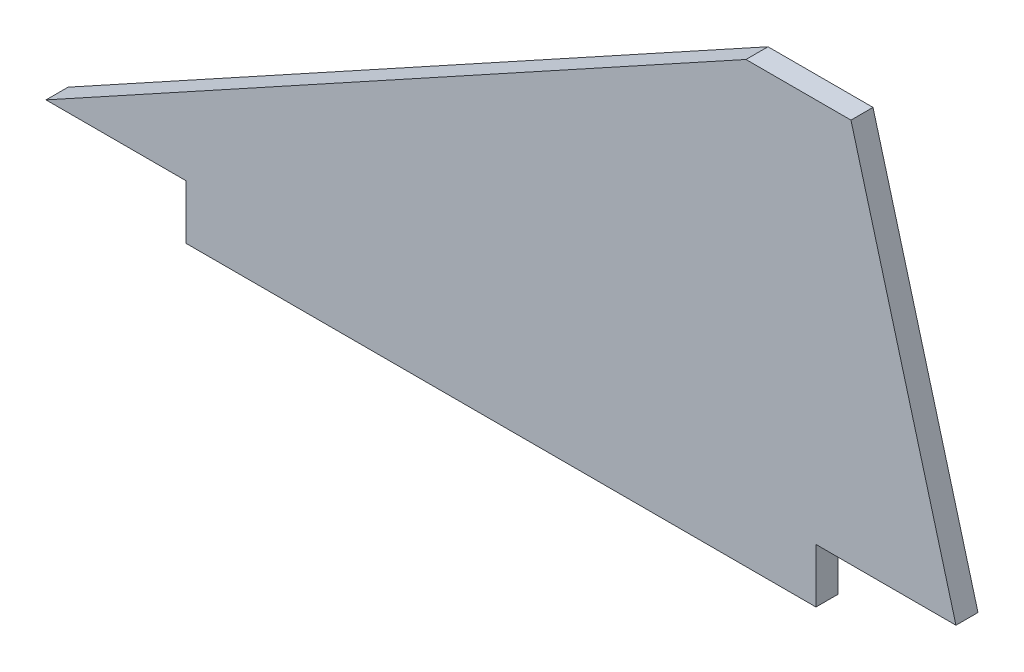
ISO-10303-21;
HEADER;
FILE_DESCRIPTION(('STEP AP214'),'2;1');
FILE_NAME('part.step','',(''),(''),'','','');
FILE_SCHEMA(('AUTOMOTIVE_DESIGN { 1 0 10303 214 1 1 1 1 }'));
ENDSEC;
DATA;
#1=APPLICATION_CONTEXT('core data for automotive mechanical design processes');
#2=APPLICATION_PROTOCOL_DEFINITION('international standard','automotive_design',2000,#1);
#3=PRODUCT_CONTEXT('',#1,'mechanical');
#4=PRODUCT('Part','Part','',(#3));
#5=PRODUCT_RELATED_PRODUCT_CATEGORY('part','',(#4));
#6=PRODUCT_DEFINITION_FORMATION('','',#4);
#7=PRODUCT_DEFINITION_CONTEXT('part definition',#1,'design');
#8=PRODUCT_DEFINITION('design','',#6,#7);
#9=PRODUCT_DEFINITION_SHAPE('','',#8);
#10=(LENGTH_UNIT() NAMED_UNIT(*) SI_UNIT(.MILLI.,.METRE.));
#11=(NAMED_UNIT(*) PLANE_ANGLE_UNIT() SI_UNIT($,.RADIAN.));
#12=(NAMED_UNIT(*) SI_UNIT($,.STERADIAN.) SOLID_ANGLE_UNIT());
#13=UNCERTAINTY_MEASURE_WITH_UNIT(LENGTH_MEASURE(1.E-05),#10,'distance_accuracy_value','');
#14=(GEOMETRIC_REPRESENTATION_CONTEXT(3) GLOBAL_UNCERTAINTY_ASSIGNED_CONTEXT((#13)) GLOBAL_UNIT_ASSIGNED_CONTEXT((#10,
#11,#12)) REPRESENTATION_CONTEXT('',''));
#15=CARTESIAN_POINT('',(0.,0.,0.));
#16=DIRECTION('',(0.,0.,1.));
#17=DIRECTION('',(1.,0.,0.));
#18=AXIS2_PLACEMENT_3D('',#15,#16,#17);
#19=CARTESIAN_POINT('',(100.,55.,3.1496));
#20=DIRECTION('',(0.481918749772156,-0.876215908676647,0.));
#21=DIRECTION('',(0.876215908676647,0.481918749772156,0.));
#22=AXIS2_PLACEMENT_3D('',#19,#20,#21);
#23=PLANE('',#22);
#24=DIRECTION('',(-0.876215908676647,-0.481918749772156,0.));
#25=VECTOR('',#24,1.);
#26=CARTESIAN_POINT('',(100.,55.,0.));
#27=LINE('',#26,#25);
#28=CARTESIAN_POINT('',(100.,55.,0.));
#29=VERTEX_POINT('',#28);
#30=CARTESIAN_POINT('',(0.,0.,0.));
#31=VERTEX_POINT('',#30);
#32=EDGE_CURVE('E130',#29,#31,#27,.T.);
#33=ORIENTED_EDGE('',*,*,#32,.T.);
#34=DIRECTION('',(0.,0.,-1.));
#35=VECTOR('',#34,1.);
#36=CARTESIAN_POINT('',(0.,0.,3.1496));
#37=LINE('',#36,#35);
#38=CARTESIAN_POINT('',(0.,0.,3.1496));
#39=VERTEX_POINT('',#38);
#40=EDGE_CURVE('E11',#39,#31,#37,.T.);
#41=ORIENTED_EDGE('',*,*,#40,.F.);
#42=DIRECTION('',(-0.876215908676647,-0.481918749772156,0.));
#43=VECTOR('',#42,1.);
#44=CARTESIAN_POINT('',(100.,55.,3.1496));
#45=LINE('',#44,#43);
#46=CARTESIAN_POINT('',(100.,55.,3.1496));
#47=VERTEX_POINT('',#46);
#48=EDGE_CURVE('E144',#47,#39,#45,.T.);
#49=ORIENTED_EDGE('',*,*,#48,.F.);
#50=DIRECTION('',(0.,0.,-1.));
#51=VECTOR('',#50,1.);
#52=CARTESIAN_POINT('',(100.,55.,3.1496));
#53=LINE('',#52,#51);
#54=EDGE_CURVE('E126',#47,#29,#53,.T.);
#55=ORIENTED_EDGE('',*,*,#54,.T.);
#56=EDGE_LOOP('',(#33,#41,#49,#55));
#57=FACE_BOUND('',#56,.T.);
#58=ADVANCED_FACE('F34',(#57),#23,.F.);
#59=CARTESIAN_POINT('',(0.,0.,3.1496));
#60=DIRECTION('',(0.,1.,0.));
#61=DIRECTION('',(0.,0.,1.));
#62=AXIS2_PLACEMENT_3D('',#59,#60,#61);
#63=PLANE('',#62);
#64=DIRECTION('',(1.,0.,0.));
#65=VECTOR('',#64,1.);
#66=CARTESIAN_POINT('',(0.,0.,0.));
#67=LINE('',#66,#65);
#68=CARTESIAN_POINT('',(20.,0.,0.));
#69=VERTEX_POINT('',#68);
#70=EDGE_CURVE('E133',#31,#69,#67,.T.);
#71=ORIENTED_EDGE('',*,*,#70,.T.);
#72=DIRECTION('',(0.,0.,-1.));
#73=VECTOR('',#72,1.);
#74=CARTESIAN_POINT('',(20.,0.,3.1496));
#75=LINE('',#74,#73);
#76=CARTESIAN_POINT('',(20.,0.,3.1496));
#77=VERTEX_POINT('',#76);
#78=EDGE_CURVE('E42',#77,#69,#75,.T.);
#79=ORIENTED_EDGE('',*,*,#78,.F.);
#80=DIRECTION('',(1.,0.,0.));
#81=VECTOR('',#80,1.);
#82=CARTESIAN_POINT('',(0.,0.,3.1496));
#83=LINE('',#82,#81);
#84=EDGE_CURVE('E93',#39,#77,#83,.T.);
#85=ORIENTED_EDGE('',*,*,#84,.F.);
#86=ORIENTED_EDGE('',*,*,#40,.T.);
#87=EDGE_LOOP('',(#71,#79,#85,#86));
#88=FACE_BOUND('',#87,.T.);
#89=ADVANCED_FACE('F179',(#88),#63,.F.);
#90=CARTESIAN_POINT('',(20.,0.,3.1496));
#91=DIRECTION('',(1.,0.,0.));
#92=DIRECTION('',(0.,0.,-1.));
#93=AXIS2_PLACEMENT_3D('',#90,#91,#92);
#94=PLANE('',#93);
#95=DIRECTION('',(0.,-1.,0.));
#96=VECTOR('',#95,1.);
#97=CARTESIAN_POINT('',(20.,0.,0.));
#98=LINE('',#97,#96);
#99=CARTESIAN_POINT('',(20.,-7.747,0.));
#100=VERTEX_POINT('',#99);
#101=EDGE_CURVE('E135',#69,#100,#98,.T.);
#102=ORIENTED_EDGE('',*,*,#101,.T.);
#103=DIRECTION('',(0.,0.,-1.));
#104=VECTOR('',#103,1.);
#105=CARTESIAN_POINT('',(20.,-7.747,3.1496));
#106=LINE('',#105,#104);
#107=CARTESIAN_POINT('',(20.,-7.747,3.1496));
#108=VERTEX_POINT('',#107);
#109=EDGE_CURVE('E151',#108,#100,#106,.T.);
#110=ORIENTED_EDGE('',*,*,#109,.F.);
#111=DIRECTION('',(0.,-1.,0.));
#112=VECTOR('',#111,1.);
#113=CARTESIAN_POINT('',(20.,0.,3.1496));
#114=LINE('',#113,#112);
#115=EDGE_CURVE('E159',#77,#108,#114,.T.);
#116=ORIENTED_EDGE('',*,*,#115,.F.);
#117=ORIENTED_EDGE('',*,*,#78,.T.);
#118=EDGE_LOOP('',(#102,#110,#116,#117));
#119=FACE_BOUND('',#118,.T.);
#120=ADVANCED_FACE('F157',(#119),#94,.F.);
#121=CARTESIAN_POINT('',(20.,-7.747,3.1496));
#122=DIRECTION('',(0.,1.,0.));
#123=DIRECTION('',(0.,0.,1.));
#124=AXIS2_PLACEMENT_3D('',#121,#122,#123);
#125=PLANE('',#124);
#126=DIRECTION('',(1.,0.,0.));
#127=VECTOR('',#126,1.);
#128=CARTESIAN_POINT('',(20.,-7.747,0.));
#129=LINE('',#128,#127);
#130=CARTESIAN_POINT('',(110.,-7.747,0.));
#131=VERTEX_POINT('',#130);
#132=EDGE_CURVE('E137',#100,#131,#129,.T.);
#133=ORIENTED_EDGE('',*,*,#132,.T.);
#134=DIRECTION('',(0.,0.,-1.));
#135=VECTOR('',#134,1.);
#136=CARTESIAN_POINT('',(110.,-7.747,3.1496));
#137=LINE('',#136,#135);
#138=CARTESIAN_POINT('',(110.,-7.747,3.1496));
#139=VERTEX_POINT('',#138);
#140=EDGE_CURVE('E148',#139,#131,#137,.T.);
#141=ORIENTED_EDGE('',*,*,#140,.F.);
#142=DIRECTION('',(1.,0.,0.));
#143=VECTOR('',#142,1.);
#144=CARTESIAN_POINT('',(20.,-7.747,3.1496));
#145=LINE('',#144,#143);
#146=EDGE_CURVE('E171',#108,#139,#145,.T.);
#147=ORIENTED_EDGE('',*,*,#146,.F.);
#148=ORIENTED_EDGE('',*,*,#109,.T.);
#149=EDGE_LOOP('',(#133,#141,#147,#148));
#150=FACE_BOUND('',#149,.T.);
#151=ADVANCED_FACE('F167',(#150),#125,.F.);
#152=CARTESIAN_POINT('',(110.,-7.747,3.1496));
#153=DIRECTION('',(-1.,0.,0.));
#154=DIRECTION('',(0.,0.,1.));
#155=AXIS2_PLACEMENT_3D('',#152,#153,#154);
#156=PLANE('',#155);
#157=DIRECTION('',(0.,1.,0.));
#158=VECTOR('',#157,1.);
#159=CARTESIAN_POINT('',(110.,-7.747,0.));
#160=LINE('',#159,#158);
#161=CARTESIAN_POINT('',(110.,0.,0.));
#162=VERTEX_POINT('',#161);
#163=EDGE_CURVE('E139',#131,#162,#160,.T.);
#164=ORIENTED_EDGE('',*,*,#163,.T.);
#165=DIRECTION('',(0.,0.,-1.));
#166=VECTOR('',#165,1.);
#167=CARTESIAN_POINT('',(110.,0.,3.1496));
#168=LINE('',#167,#166);
#169=CARTESIAN_POINT('',(110.,0.,3.1496));
#170=VERTEX_POINT('',#169);
#171=EDGE_CURVE('E121',#170,#162,#168,.T.);
#172=ORIENTED_EDGE('',*,*,#171,.F.);
#173=DIRECTION('',(0.,1.,0.));
#174=VECTOR('',#173,1.);
#175=CARTESIAN_POINT('',(110.,-7.747,3.1496));
#176=LINE('',#175,#174);
#177=EDGE_CURVE('E112',#139,#170,#176,.T.);
#178=ORIENTED_EDGE('',*,*,#177,.F.);
#179=ORIENTED_EDGE('',*,*,#140,.T.);
#180=EDGE_LOOP('',(#164,#172,#178,#179));
#181=FACE_BOUND('',#180,.T.);
#182=ADVANCED_FACE('F170',(#181),#156,.F.);
#183=CARTESIAN_POINT('',(110.,0.,3.1496));
#184=DIRECTION('',(0.,1.,0.));
#185=DIRECTION('',(0.,0.,1.));
#186=AXIS2_PLACEMENT_3D('',#183,#184,#185);
#187=PLANE('',#186);
#188=DIRECTION('',(1.,0.,0.));
#189=VECTOR('',#188,1.);
#190=CARTESIAN_POINT('',(110.,0.,0.));
#191=LINE('',#190,#189);
#192=CARTESIAN_POINT('',(130.,0.,0.));
#193=VERTEX_POINT('',#192);
#194=EDGE_CURVE('E120',#162,#193,#191,.T.);
#195=ORIENTED_EDGE('',*,*,#194,.T.);
#196=DIRECTION('',(0.,0.,-1.));
#197=VECTOR('',#196,1.);
#198=CARTESIAN_POINT('',(130.,0.,3.1496));
#199=LINE('',#198,#197);
#200=CARTESIAN_POINT('',(130.,0.,3.1496));
#201=VERTEX_POINT('',#200);
#202=EDGE_CURVE('E117',#201,#193,#199,.T.);
#203=ORIENTED_EDGE('',*,*,#202,.F.);
#204=DIRECTION('',(1.,0.,0.));
#205=VECTOR('',#204,1.);
#206=CARTESIAN_POINT('',(110.,0.,3.1496));
#207=LINE('',#206,#205);
#208=EDGE_CURVE('E106',#170,#201,#207,.T.);
#209=ORIENTED_EDGE('',*,*,#208,.F.);
#210=ORIENTED_EDGE('',*,*,#171,.T.);
#211=EDGE_LOOP('',(#195,#203,#209,#210));
#212=FACE_BOUND('',#211,.T.);
#213=ADVANCED_FACE('F118',(#212),#187,.F.);
#214=CARTESIAN_POINT('',(130.,0.,3.1496));
#215=DIRECTION('',(-0.964763821237732,-0.263117405792109,0.));
#216=DIRECTION('',(0.263117405792109,-0.964763821237732,0.));
#217=AXIS2_PLACEMENT_3D('',#214,#215,#216);
#218=PLANE('',#217);
#219=DIRECTION('',(-0.263117405792109,0.964763821237732,0.));
#220=VECTOR('',#219,1.);
#221=CARTESIAN_POINT('',(130.,0.,0.));
#222=LINE('',#221,#220);
#223=CARTESIAN_POINT('',(115.,55.,0.));
#224=VERTEX_POINT('',#223);
#225=EDGE_CURVE('E79',#193,#224,#222,.T.);
#226=ORIENTED_EDGE('',*,*,#225,.T.);
#227=DIRECTION('',(0.,0.,-1.));
#228=VECTOR('',#227,1.);
#229=CARTESIAN_POINT('',(115.,55.,3.1496));
#230=LINE('',#229,#228);
#231=CARTESIAN_POINT('',(115.,55.,3.1496));
#232=VERTEX_POINT('',#231);
#233=EDGE_CURVE('E122',#232,#224,#230,.T.);
#234=ORIENTED_EDGE('',*,*,#233,.F.);
#235=DIRECTION('',(-0.263117405792109,0.964763821237732,0.));
#236=VECTOR('',#235,1.);
#237=CARTESIAN_POINT('',(130.,0.,3.1496));
#238=LINE('',#237,#236);
#239=EDGE_CURVE('E110',#201,#232,#238,.T.);
#240=ORIENTED_EDGE('',*,*,#239,.F.);
#241=ORIENTED_EDGE('',*,*,#202,.T.);
#242=EDGE_LOOP('',(#226,#234,#240,#241));
#243=FACE_BOUND('',#242,.T.);
#244=ADVANCED_FACE('F124',(#243),#218,.F.);
#245=CARTESIAN_POINT('',(115.,55.,3.1496));
#246=DIRECTION('',(0.,-1.,0.));
#247=DIRECTION('',(0.,0.,-1.));
#248=AXIS2_PLACEMENT_3D('',#245,#246,#247);
#249=PLANE('',#248);
#250=DIRECTION('',(-1.,0.,0.));
#251=VECTOR('',#250,1.);
#252=CARTESIAN_POINT('',(115.,55.,0.));
#253=LINE('',#252,#251);
#254=EDGE_CURVE('E85',#224,#29,#253,.T.);
#255=ORIENTED_EDGE('',*,*,#254,.T.);
#256=ORIENTED_EDGE('',*,*,#54,.F.);
#257=DIRECTION('',(-1.,0.,0.));
#258=VECTOR('',#257,1.);
#259=CARTESIAN_POINT('',(115.,55.,3.1496));
#260=LINE('',#259,#258);
#261=EDGE_CURVE('E50',#232,#47,#260,.T.);
#262=ORIENTED_EDGE('',*,*,#261,.F.);
#263=ORIENTED_EDGE('',*,*,#233,.T.);
#264=EDGE_LOOP('',(#255,#256,#262,#263));
#265=FACE_BOUND('',#264,.T.);
#266=ADVANCED_FACE('F195',(#265),#249,.F.);
#267=CARTESIAN_POINT('',(0.,0.,3.1496));
#268=DIRECTION('',(0.,0.,-1.));
#269=DIRECTION('',(-1.,0.,0.));
#270=AXIS2_PLACEMENT_3D('',#267,#268,#269);
#271=PLANE('',#270);
#272=ORIENTED_EDGE('',*,*,#48,.T.);
#273=ORIENTED_EDGE('',*,*,#84,.T.);
#274=ORIENTED_EDGE('',*,*,#115,.T.);
#275=ORIENTED_EDGE('',*,*,#146,.T.);
#276=ORIENTED_EDGE('',*,*,#177,.T.);
#277=ORIENTED_EDGE('',*,*,#208,.T.);
#278=ORIENTED_EDGE('',*,*,#239,.T.);
#279=ORIENTED_EDGE('',*,*,#261,.T.);
#280=EDGE_LOOP('',(#272,#273,#274,#275,#276,#277,#278,#279));
#281=FACE_BOUND('',#280,.T.);
#282=ADVANCED_FACE('F108',(#281),#271,.F.);
#283=CARTESIAN_POINT('',(0.,0.,0.));
#284=DIRECTION('',(0.,0.,-1.));
#285=DIRECTION('',(-1.,0.,0.));
#286=AXIS2_PLACEMENT_3D('',#283,#284,#285);
#287=PLANE('',#286);
#288=ORIENTED_EDGE('',*,*,#32,.F.);
#289=ORIENTED_EDGE('',*,*,#254,.F.);
#290=ORIENTED_EDGE('',*,*,#225,.F.);
#291=ORIENTED_EDGE('',*,*,#194,.F.);
#292=ORIENTED_EDGE('',*,*,#163,.F.);
#293=ORIENTED_EDGE('',*,*,#132,.F.);
#294=ORIENTED_EDGE('',*,*,#101,.F.);
#295=ORIENTED_EDGE('',*,*,#70,.F.);
#296=EDGE_LOOP('',(#288,#289,#290,#291,#292,#293,#294,#295));
#297=FACE_BOUND('',#296,.T.);
#298=ADVANCED_FACE('F163',(#297),#287,.T.);
#299=CLOSED_SHELL('',(#58,#89,#120,#151,#182,#213,#244,#266,#282,#298));
#300=MANIFOLD_SOLID_BREP('B2',#299);
#301=ADVANCED_BREP_SHAPE_REPRESENTATION('',(#18,#300),#14);
#302=SHAPE_DEFINITION_REPRESENTATION(#9,#301);
ENDSEC;
END-ISO-10303-21;
